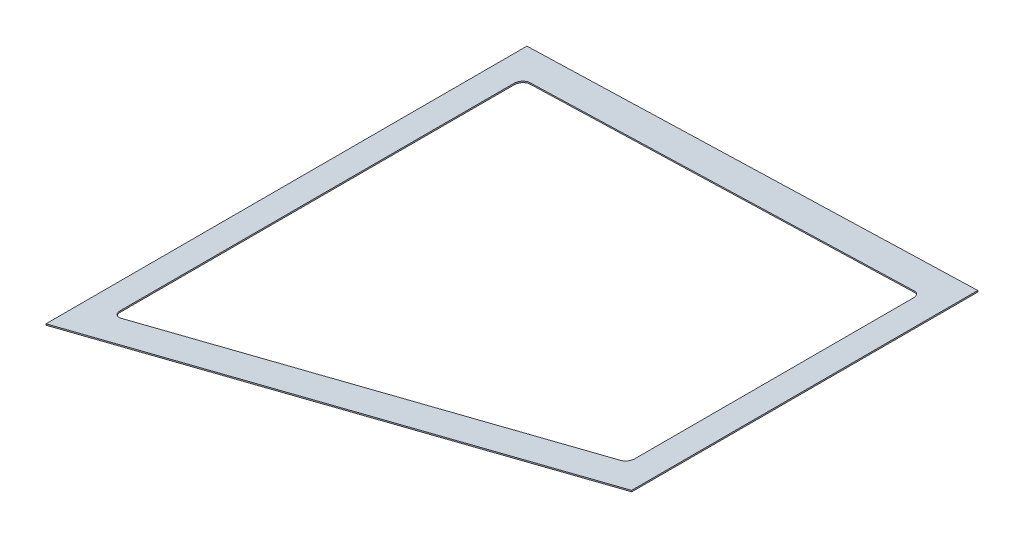
ISO-10303-21;
HEADER;
FILE_DESCRIPTION(('STEP AP214'),'2;1');
FILE_NAME('part.step','',(''),(''),'','','');
FILE_SCHEMA(('AUTOMOTIVE_DESIGN { 1 0 10303 214 1 1 1 1 }'));
ENDSEC;
DATA;
#1=APPLICATION_CONTEXT('core data for automotive mechanical design processes');
#2=APPLICATION_PROTOCOL_DEFINITION('international standard','automotive_design',2000,#1);
#3=PRODUCT_CONTEXT('',#1,'mechanical');
#4=PRODUCT('Part','Part','',(#3));
#5=PRODUCT_RELATED_PRODUCT_CATEGORY('part','',(#4));
#6=PRODUCT_DEFINITION_FORMATION('','',#4);
#7=PRODUCT_DEFINITION_CONTEXT('part definition',#1,'design');
#8=PRODUCT_DEFINITION('design','',#6,#7);
#9=PRODUCT_DEFINITION_SHAPE('','',#8);
#10=(LENGTH_UNIT() NAMED_UNIT(*) SI_UNIT(.MILLI.,.METRE.));
#11=(NAMED_UNIT(*) PLANE_ANGLE_UNIT() SI_UNIT($,.RADIAN.));
#12=(NAMED_UNIT(*) SI_UNIT($,.STERADIAN.) SOLID_ANGLE_UNIT());
#13=UNCERTAINTY_MEASURE_WITH_UNIT(LENGTH_MEASURE(1.E-05),#10,'distance_accuracy_value','');
#14=(GEOMETRIC_REPRESENTATION_CONTEXT(3) GLOBAL_UNCERTAINTY_ASSIGNED_CONTEXT((#13)) GLOBAL_UNIT_ASSIGNED_CONTEXT((#10,
#11,#12)) REPRESENTATION_CONTEXT('',''));
#15=CARTESIAN_POINT('',(0.,0.,0.));
#16=DIRECTION('',(0.,0.,1.));
#17=DIRECTION('',(1.,0.,0.));
#18=AXIS2_PLACEMENT_3D('',#15,#16,#17);
#19=CARTESIAN_POINT('',(2090.86017918312,60.2389706566354,194.317166251865));
#20=DIRECTION('',(0.154776003065257,-0.987949588225606,0.));
#21=DIRECTION('',(0.987949588225606,0.154776003065257,0.));
#22=AXIS2_PLACEMENT_3D('',#19,#20,#21);
#23=PLANE('',#22);
#24=DIRECTION('',(-0.979909680727832,-0.153516440064927,0.127317399618708));
#25=VECTOR('',#24,1.);
#26=CARTESIAN_POINT('',(2509.68068330087,125.853010483855,139.90078631401));
#27=LINE('',#26,#25);
#28=CARTESIAN_POINT('',(2509.68068330087,125.853010483855,139.90078631401));
#29=VERTEX_POINT('',#28);
#30=CARTESIAN_POINT('',(2090.86017918312,60.2389706566354,194.317166251865));
#31=VERTEX_POINT('',#30);
#32=EDGE_CURVE('E189',#29,#31,#27,.T.);
#33=ORIENTED_EDGE('',*,*,#32,.T.);
#34=DIRECTION('',(0.,0.,-1.));
#35=VECTOR('',#34,1.);
#36=CARTESIAN_POINT('',(2090.86017918312,60.2389706566354,194.317166251865));
#37=LINE('',#36,#35);
#38=CARTESIAN_POINT('',(2090.86017918312,60.2389706566354,-194.317166251865));
#39=VERTEX_POINT('',#38);
#40=EDGE_CURVE('E192',#31,#39,#37,.T.);
#41=ORIENTED_EDGE('',*,*,#40,.T.);
#42=DIRECTION('',(0.979909680727832,0.153516440064927,0.127317399618708));
#43=VECTOR('',#42,1.);
#44=CARTESIAN_POINT('',(2509.68068330087,125.853010483855,-139.90078631401));
#45=LINE('',#44,#43);
#46=CARTESIAN_POINT('',(2509.68068330087,125.853010483855,-139.90078631401));
#47=VERTEX_POINT('',#46);
#48=EDGE_CURVE('E195',#39,#47,#45,.T.);
#49=ORIENTED_EDGE('',*,*,#48,.T.);
#50=DIRECTION('',(0.,0.,1.));
#51=VECTOR('',#50,1.);
#52=CARTESIAN_POINT('',(2509.68068330087,125.853010483855,-58.4447746409123));
#53=LINE('',#52,#51);
#54=EDGE_CURVE('E197',#47,#29,#53,.T.);
#55=ORIENTED_EDGE('',*,*,#54,.T.);
#56=EDGE_LOOP('',(#33,#41,#49,#55));
#57=FACE_BOUND('',#56,.T.);
#58=DIRECTION('',(-0.979909680727832,-0.153516440064927,0.127317399618708));
#59=VECTOR('',#58,1.);
#60=CARTESIAN_POINT('',(2479.80894510104,121.173188458234,118.576833620302));
#61=LINE('',#60,#59);
#62=CARTESIAN_POINT('',(2479.80894510104,121.173188458234,118.576833620302));
#63=VERTEX_POINT('',#62);
#64=CARTESIAN_POINT('',(2122.24131545328,65.1552608210602,165.034769172857));
#65=VERTEX_POINT('',#64);
#66=EDGE_CURVE('E132',#63,#65,#61,.T.);
#67=ORIENTED_EDGE('',*,*,#66,.F.);
#68=CARTESIAN_POINT('',(2479.05424606587,121.054954388832,112.625661460874));
#69=DIRECTION('',(0.154776003065257,-0.987949588225606,0.));
#70=DIRECTION('',(-0.987949588225606,-0.154776003065257,0.));
#71=AXIS2_PLACEMENT_3D('',#68,#69,#70);
#72=CIRCLE('',#71,6.00000000000027);
#73=CARTESIAN_POINT('',(2484.98194359523,121.983610407224,112.625661460874));
#74=VERTEX_POINT('',#73);
#75=EDGE_CURVE('E124',#74,#63,#72,.T.);
#76=ORIENTED_EDGE('',*,*,#75,.F.);
#77=DIRECTION('',(0.,0.,1.));
#78=VECTOR('',#77,1.);
#79=CARTESIAN_POINT('',(2484.98194359523,121.983610407224,-58.4447746409126));
#80=LINE('',#79,#78);
#81=CARTESIAN_POINT('',(2484.98194359522,121.983610407224,-112.625661460874));
#82=VERTEX_POINT('',#81);
#83=EDGE_CURVE('E157',#82,#74,#80,.T.);
#84=ORIENTED_EDGE('',*,*,#83,.F.);
#85=CARTESIAN_POINT('',(2479.05424606587,121.054954388832,-112.625661460874));
#86=DIRECTION('',(0.154776003065257,-0.987949588225606,0.));
#87=DIRECTION('',(0.987949588225606,0.154776003065257,0.));
#88=AXIS2_PLACEMENT_3D('',#85,#86,#87);
#89=CIRCLE('',#88,6.00000000000027);
#90=CARTESIAN_POINT('',(2479.80894510104,121.173188458234,-118.576833620302));
#91=VERTEX_POINT('',#90);
#92=EDGE_CURVE('E155',#91,#82,#89,.T.);
#93=ORIENTED_EDGE('',*,*,#92,.F.);
#94=DIRECTION('',(0.979909680727832,0.153516440064927,0.127317399618708));
#95=VECTOR('',#94,1.);
#96=CARTESIAN_POINT('',(2479.80894510104,121.173188458234,-118.576833620302));
#97=LINE('',#96,#95);
#98=CARTESIAN_POINT('',(2122.24131545328,65.1552608210602,-165.034769172857));
#99=VERTEX_POINT('',#98);
#100=EDGE_CURVE('E153',#99,#91,#97,.T.);
#101=ORIENTED_EDGE('',*,*,#100,.F.);
#102=CARTESIAN_POINT('',(2121.48661641812,65.0370267516584,-159.083597013428));
#103=DIRECTION('',(0.154776003065257,-0.987949588225606,0.));
#104=DIRECTION('',(0.987949588225606,0.154776003065257,0.));
#105=AXIS2_PLACEMENT_3D('',#102,#103,#104);
#106=CIRCLE('',#105,6.00000000000024);
#107=CARTESIAN_POINT('',(2115.55891888876,64.1083707332668,-159.083597013428));
#108=VERTEX_POINT('',#107);
#109=EDGE_CURVE('E151',#108,#99,#106,.T.);
#110=ORIENTED_EDGE('',*,*,#109,.F.);
#111=DIRECTION('',(0.,0.,-1.));
#112=VECTOR('',#111,1.);
#113=CARTESIAN_POINT('',(2115.55891888876,64.1083707332668,159.083597013428));
#114=LINE('',#113,#112);
#115=CARTESIAN_POINT('',(2115.55891888876,64.1083707332668,159.083597013428));
#116=VERTEX_POINT('',#115);
#117=EDGE_CURVE('E147',#116,#108,#114,.T.);
#118=ORIENTED_EDGE('',*,*,#117,.F.);
#119=CARTESIAN_POINT('',(2121.48661641812,65.0370267516584,159.083597013428));
#120=DIRECTION('',(0.154776003065257,-0.987949588225606,0.));
#121=DIRECTION('',(-0.987949588225606,-0.154776003065257,0.));
#122=AXIS2_PLACEMENT_3D('',#119,#120,#121);
#123=CIRCLE('',#122,6.00000000000024);
#124=EDGE_CURVE('E145',#65,#116,#123,.T.);
#125=ORIENTED_EDGE('',*,*,#124,.F.);
#126=EDGE_LOOP('',(#67,#76,#84,#93,#101,#110,#118,#125));
#127=FACE_BOUND('',#126,.T.);
#128=ADVANCED_FACE('F35',(#57,#127),#23,.T.);
#129=CARTESIAN_POINT('',(2090.70540318006,61.226920244861,194.317166251865));
#130=DIRECTION('',(0.154776003065257,-0.987949588225606,0.));
#131=DIRECTION('',(0.987949588225606,0.154776003065257,0.));
#132=AXIS2_PLACEMENT_3D('',#129,#130,#131);
#133=PLANE('',#132);
#134=DIRECTION('',(-0.979909680727832,-0.153516440064927,0.127317399618708));
#135=VECTOR('',#134,1.);
#136=CARTESIAN_POINT('',(2509.5259072978,126.840960072081,139.90078631401));
#137=LINE('',#136,#135);
#138=CARTESIAN_POINT('',(2509.5259072978,126.840960072081,139.90078631401));
#139=VERTEX_POINT('',#138);
#140=CARTESIAN_POINT('',(2090.70540318006,61.226920244861,194.317166251865));
#141=VERTEX_POINT('',#140);
#142=EDGE_CURVE('E140',#139,#141,#137,.T.);
#143=ORIENTED_EDGE('',*,*,#142,.F.);
#144=DIRECTION('',(0.,0.,1.));
#145=VECTOR('',#144,1.);
#146=CARTESIAN_POINT('',(2509.5259072978,126.840960072081,58.4447746409121));
#147=LINE('',#146,#145);
#148=CARTESIAN_POINT('',(2509.5259072978,126.840960072081,-139.90078631401));
#149=VERTEX_POINT('',#148);
#150=EDGE_CURVE('E193',#149,#139,#147,.T.);
#151=ORIENTED_EDGE('',*,*,#150,.F.);
#152=DIRECTION('',(0.979909680727832,0.153516440064927,0.127317399618708));
#153=VECTOR('',#152,1.);
#154=CARTESIAN_POINT('',(2509.5259072978,126.840960072081,-139.90078631401));
#155=LINE('',#154,#153);
#156=CARTESIAN_POINT('',(2090.70540318006,61.226920244861,-194.317166251865));
#157=VERTEX_POINT('',#156);
#158=EDGE_CURVE('E204',#157,#149,#155,.T.);
#159=ORIENTED_EDGE('',*,*,#158,.F.);
#160=DIRECTION('',(0.,0.,-1.));
#161=VECTOR('',#160,1.);
#162=CARTESIAN_POINT('',(2090.70540318006,61.226920244861,194.317166251865));
#163=LINE('',#162,#161);
#164=EDGE_CURVE('E202',#141,#157,#163,.T.);
#165=ORIENTED_EDGE('',*,*,#164,.F.);
#166=EDGE_LOOP('',(#143,#151,#159,#165));
#167=FACE_BOUND('',#166,.T.);
#168=CARTESIAN_POINT('',(2478.89947006281,122.042903977058,112.625661460874));
#169=DIRECTION('',(0.154776003065257,-0.987949588225606,0.));
#170=DIRECTION('',(-0.987949588225606,-0.154776003065257,0.));
#171=AXIS2_PLACEMENT_3D('',#168,#169,#170);
#172=CIRCLE('',#171,6.00000000000027);
#173=CARTESIAN_POINT('',(2484.82716759216,122.97155999545,112.625661460874));
#174=VERTEX_POINT('',#173);
#175=CARTESIAN_POINT('',(2479.65416909797,122.16113804646,118.576833620302));
#176=VERTEX_POINT('',#175);
#177=EDGE_CURVE('E58',#174,#176,#172,.T.);
#178=ORIENTED_EDGE('',*,*,#177,.T.);
#179=DIRECTION('',(-0.979909680727832,-0.153516440064927,0.127317399618708));
#180=VECTOR('',#179,1.);
#181=CARTESIAN_POINT('',(2479.65416909797,122.16113804646,118.576833620302));
#182=LINE('',#181,#180);
#183=CARTESIAN_POINT('',(2122.08653945021,66.1432104092858,165.034769172857));
#184=VERTEX_POINT('',#183);
#185=EDGE_CURVE('E139',#176,#184,#182,.T.);
#186=ORIENTED_EDGE('',*,*,#185,.T.);
#187=CARTESIAN_POINT('',(2121.33184041505,66.024976339884,159.083597013428));
#188=DIRECTION('',(0.154776003065257,-0.987949588225606,0.));
#189=DIRECTION('',(-0.987949588225606,-0.154776003065257,0.));
#190=AXIS2_PLACEMENT_3D('',#187,#188,#189);
#191=CIRCLE('',#190,6.00000000000024);
#192=CARTESIAN_POINT('',(2115.4041428857,65.0963203214924,159.083597013428));
#193=VERTEX_POINT('',#192);
#194=EDGE_CURVE('E161',#184,#193,#191,.T.);
#195=ORIENTED_EDGE('',*,*,#194,.T.);
#196=DIRECTION('',(0.,0.,-1.));
#197=VECTOR('',#196,1.);
#198=CARTESIAN_POINT('',(2115.4041428857,65.0963203214924,159.083597013428));
#199=LINE('',#198,#197);
#200=CARTESIAN_POINT('',(2115.4041428857,65.0963203214924,-159.083597013428));
#201=VERTEX_POINT('',#200);
#202=EDGE_CURVE('E164',#193,#201,#199,.T.);
#203=ORIENTED_EDGE('',*,*,#202,.T.);
#204=CARTESIAN_POINT('',(2121.33184041505,66.024976339884,-159.083597013428));
#205=DIRECTION('',(0.154776003065257,-0.987949588225606,0.));
#206=DIRECTION('',(0.987949588225606,0.154776003065257,0.));
#207=AXIS2_PLACEMENT_3D('',#204,#205,#206);
#208=CIRCLE('',#207,6.00000000000024);
#209=CARTESIAN_POINT('',(2122.08653945021,66.1432104092858,-165.034769172857));
#210=VERTEX_POINT('',#209);
#211=EDGE_CURVE('E167',#201,#210,#208,.T.);
#212=ORIENTED_EDGE('',*,*,#211,.T.);
#213=DIRECTION('',(0.979909680727832,0.153516440064927,0.127317399618708));
#214=VECTOR('',#213,1.);
#215=CARTESIAN_POINT('',(2479.65416909797,122.16113804646,-118.576833620302));
#216=LINE('',#215,#214);
#217=CARTESIAN_POINT('',(2479.65416909797,122.16113804646,-118.576833620302));
#218=VERTEX_POINT('',#217);
#219=EDGE_CURVE('E170',#210,#218,#216,.T.);
#220=ORIENTED_EDGE('',*,*,#219,.T.);
#221=CARTESIAN_POINT('',(2478.89947006281,122.042903977058,-112.625661460874));
#222=DIRECTION('',(0.154776003065257,-0.987949588225606,0.));
#223=DIRECTION('',(0.987949588225606,0.154776003065257,0.));
#224=AXIS2_PLACEMENT_3D('',#221,#222,#223);
#225=CIRCLE('',#224,6.00000000000027);
#226=CARTESIAN_POINT('',(2484.82716759216,122.971559995449,-112.625661460874));
#227=VERTEX_POINT('',#226);
#228=EDGE_CURVE('E173',#218,#227,#225,.T.);
#229=ORIENTED_EDGE('',*,*,#228,.T.);
#230=DIRECTION('',(0.,0.,1.));
#231=VECTOR('',#230,1.);
#232=CARTESIAN_POINT('',(2484.82716759216,122.971559995449,58.4447746409123));
#233=LINE('',#232,#231);
#234=EDGE_CURVE('E133',#227,#174,#233,.T.);
#235=ORIENTED_EDGE('',*,*,#234,.T.);
#236=EDGE_LOOP('',(#178,#186,#195,#203,#212,#220,#229,#235));
#237=FACE_BOUND('',#236,.T.);
#238=ADVANCED_FACE('F222',(#167,#237),#133,.F.);
#239=CARTESIAN_POINT('',(2509.68068330087,125.853010483855,139.90078631401));
#240=DIRECTION('',(-0.125783172527258,-0.0197056782336455,-0.991862026571403));
#241=DIRECTION('',(-0.992054659508548,0.,0.12580760131001));
#242=AXIS2_PLACEMENT_3D('',#239,#240,#241);
#243=PLANE('',#242);
#244=ORIENTED_EDGE('',*,*,#142,.T.);
#245=DIRECTION('',(-0.154776003065256,0.987949588225606,0.));
#246=VECTOR('',#245,1.);
#247=CARTESIAN_POINT('',(2090.86017918312,60.2389706566354,194.317166251865));
#248=LINE('',#247,#246);
#249=EDGE_CURVE('E11',#31,#141,#248,.T.);
#250=ORIENTED_EDGE('',*,*,#249,.F.);
#251=ORIENTED_EDGE('',*,*,#32,.F.);
#252=DIRECTION('',(-0.154776003065256,0.987949588225606,0.));
#253=VECTOR('',#252,1.);
#254=CARTESIAN_POINT('',(2509.68068330087,125.853010483855,139.90078631401));
#255=LINE('',#254,#253);
#256=EDGE_CURVE('E199',#29,#139,#255,.T.);
#257=ORIENTED_EDGE('',*,*,#256,.T.);
#258=EDGE_LOOP('',(#244,#250,#251,#257));
#259=FACE_BOUND('',#258,.T.);
#260=ADVANCED_FACE('F37',(#259),#243,.F.);
#261=CARTESIAN_POINT('',(2090.86017918312,60.2389706566354,194.317166251865));
#262=DIRECTION('',(0.987949588225606,0.154776003065256,0.));
#263=DIRECTION('',(-0.154776003065257,0.987949588225606,0.));
#264=AXIS2_PLACEMENT_3D('',#261,#262,#263);
#265=PLANE('',#264);
#266=ORIENTED_EDGE('',*,*,#164,.T.);
#267=DIRECTION('',(-0.154776003065256,0.987949588225606,0.));
#268=VECTOR('',#267,1.);
#269=CARTESIAN_POINT('',(2090.86017918312,60.2389706566354,-194.317166251865));
#270=LINE('',#269,#268);
#271=EDGE_CURVE('E43',#39,#157,#270,.T.);
#272=ORIENTED_EDGE('',*,*,#271,.F.);
#273=ORIENTED_EDGE('',*,*,#40,.F.);
#274=ORIENTED_EDGE('',*,*,#249,.T.);
#275=EDGE_LOOP('',(#266,#272,#273,#274));
#276=FACE_BOUND('',#275,.T.);
#277=ADVANCED_FACE('F232',(#276),#265,.F.);
#278=CARTESIAN_POINT('',(2509.68068330087,125.853010483855,-139.90078631401));
#279=DIRECTION('',(-0.125783172527257,-0.0197056782336458,0.991862026571403));
#280=DIRECTION('',(0.992054659508548,0.,0.12580760131001));
#281=AXIS2_PLACEMENT_3D('',#278,#279,#280);
#282=PLANE('',#281);
#283=ORIENTED_EDGE('',*,*,#158,.T.);
#284=DIRECTION('',(-0.154776003065256,0.987949588225606,0.));
#285=VECTOR('',#284,1.);
#286=CARTESIAN_POINT('',(2509.68068330087,125.853010483855,-139.90078631401));
#287=LINE('',#286,#285);
#288=EDGE_CURVE('E210',#47,#149,#287,.T.);
#289=ORIENTED_EDGE('',*,*,#288,.F.);
#290=ORIENTED_EDGE('',*,*,#48,.F.);
#291=ORIENTED_EDGE('',*,*,#271,.T.);
#292=EDGE_LOOP('',(#283,#289,#290,#291));
#293=FACE_BOUND('',#292,.T.);
#294=ADVANCED_FACE('F217',(#293),#282,.F.);
#295=CARTESIAN_POINT('',(2509.68068330087,125.853010483855,58.4447746409121));
#296=DIRECTION('',(-0.987949588225606,-0.154776003065256,0.));
#297=DIRECTION('',(0.154776003065257,-0.987949588225606,0.));
#298=AXIS2_PLACEMENT_3D('',#295,#296,#297);
#299=PLANE('',#298);
#300=ORIENTED_EDGE('',*,*,#150,.T.);
#301=ORIENTED_EDGE('',*,*,#256,.F.);
#302=ORIENTED_EDGE('',*,*,#54,.F.);
#303=ORIENTED_EDGE('',*,*,#288,.T.);
#304=EDGE_LOOP('',(#300,#301,#302,#303));
#305=FACE_BOUND('',#304,.T.);
#306=ADVANCED_FACE('F226',(#305),#299,.F.);
#307=CARTESIAN_POINT('',(2479.05424606587,121.054954388832,112.625661460874));
#308=DIRECTION('',(-0.154776003065256,0.987949588225606,0.));
#309=DIRECTION('',(-0.987949588225606,-0.154776003065257,0.));
#310=AXIS2_PLACEMENT_3D('',#307,#308,#309);
#311=CYLINDRICAL_SURFACE('',#310,6.00000000000027);
#312=ORIENTED_EDGE('',*,*,#177,.F.);
#313=DIRECTION('',(-0.154776003065256,0.987949588225606,0.));
#314=VECTOR('',#313,1.);
#315=CARTESIAN_POINT('',(2484.98194359523,121.983610407224,112.625661460874));
#316=LINE('',#315,#314);
#317=EDGE_CURVE('E128',#74,#174,#316,.T.);
#318=ORIENTED_EDGE('',*,*,#317,.F.);
#319=ORIENTED_EDGE('',*,*,#75,.T.);
#320=DIRECTION('',(-0.154776003065256,0.987949588225606,0.));
#321=VECTOR('',#320,1.);
#322=CARTESIAN_POINT('',(2479.80894510104,121.173188458234,118.576833620302));
#323=LINE('',#322,#321);
#324=EDGE_CURVE('E127',#63,#176,#323,.T.);
#325=ORIENTED_EDGE('',*,*,#324,.T.);
#326=EDGE_LOOP('',(#312,#318,#319,#325));
#327=FACE_BOUND('',#326,.T.);
#328=ADVANCED_FACE('F126',(#327),#311,.F.);
#329=CARTESIAN_POINT('',(2479.80894510104,121.173188458234,118.576833620302));
#330=DIRECTION('',(-0.125783172527257,-0.0197056782336455,-0.991862026571403));
#331=DIRECTION('',(-0.992054659508548,0.,0.12580760131001));
#332=AXIS2_PLACEMENT_3D('',#329,#330,#331);
#333=PLANE('',#332);
#334=ORIENTED_EDGE('',*,*,#185,.F.);
#335=ORIENTED_EDGE('',*,*,#324,.F.);
#336=ORIENTED_EDGE('',*,*,#66,.T.);
#337=DIRECTION('',(-0.154776003065256,0.987949588225606,0.));
#338=VECTOR('',#337,1.);
#339=CARTESIAN_POINT('',(2122.24131545328,65.1552608210602,165.034769172857));
#340=LINE('',#339,#338);
#341=EDGE_CURVE('E141',#65,#184,#340,.T.);
#342=ORIENTED_EDGE('',*,*,#341,.T.);
#343=EDGE_LOOP('',(#334,#335,#336,#342));
#344=FACE_BOUND('',#343,.T.);
#345=ADVANCED_FACE('F136',(#344),#333,.T.);
#346=CARTESIAN_POINT('',(2121.48661641812,65.0370267516584,159.083597013428));
#347=DIRECTION('',(-0.154776003065256,0.987949588225606,0.));
#348=DIRECTION('',(-0.987949588225606,-0.154776003065257,0.));
#349=AXIS2_PLACEMENT_3D('',#346,#347,#348);
#350=CYLINDRICAL_SURFACE('',#349,6.00000000000024);
#351=ORIENTED_EDGE('',*,*,#194,.F.);
#352=ORIENTED_EDGE('',*,*,#341,.F.);
#353=ORIENTED_EDGE('',*,*,#124,.T.);
#354=DIRECTION('',(-0.154776003065256,0.987949588225606,0.));
#355=VECTOR('',#354,1.);
#356=CARTESIAN_POINT('',(2115.55891888876,64.1083707332668,159.083597013428));
#357=LINE('',#356,#355);
#358=EDGE_CURVE('E186',#116,#193,#357,.T.);
#359=ORIENTED_EDGE('',*,*,#358,.T.);
#360=EDGE_LOOP('',(#351,#352,#353,#359));
#361=FACE_BOUND('',#360,.T.);
#362=ADVANCED_FACE('F255',(#361),#350,.F.);
#363=CARTESIAN_POINT('',(2115.55891888876,64.1083707332668,159.083597013428));
#364=DIRECTION('',(0.987949588225606,0.154776003065256,0.));
#365=DIRECTION('',(-0.154776003065257,0.987949588225606,0.));
#366=AXIS2_PLACEMENT_3D('',#363,#364,#365);
#367=PLANE('',#366);
#368=ORIENTED_EDGE('',*,*,#202,.F.);
#369=ORIENTED_EDGE('',*,*,#358,.F.);
#370=ORIENTED_EDGE('',*,*,#117,.T.);
#371=DIRECTION('',(-0.154776003065256,0.987949588225606,0.));
#372=VECTOR('',#371,1.);
#373=CARTESIAN_POINT('',(2115.55891888876,64.1083707332668,-159.083597013428));
#374=LINE('',#373,#372);
#375=EDGE_CURVE('E184',#108,#201,#374,.T.);
#376=ORIENTED_EDGE('',*,*,#375,.T.);
#377=EDGE_LOOP('',(#368,#369,#370,#376));
#378=FACE_BOUND('',#377,.T.);
#379=ADVANCED_FACE('F259',(#378),#367,.T.);
#380=CARTESIAN_POINT('',(2121.48661641812,65.0370267516584,-159.083597013428));
#381=DIRECTION('',(-0.154776003065256,0.987949588225606,0.));
#382=DIRECTION('',(-0.987949588225606,-0.154776003065257,0.));
#383=AXIS2_PLACEMENT_3D('',#380,#381,#382);
#384=CYLINDRICAL_SURFACE('',#383,6.00000000000024);
#385=ORIENTED_EDGE('',*,*,#211,.F.);
#386=ORIENTED_EDGE('',*,*,#375,.F.);
#387=ORIENTED_EDGE('',*,*,#109,.T.);
#388=DIRECTION('',(-0.154776003065256,0.987949588225606,0.));
#389=VECTOR('',#388,1.);
#390=CARTESIAN_POINT('',(2122.24131545328,65.1552608210602,-165.034769172857));
#391=LINE('',#390,#389);
#392=EDGE_CURVE('E182',#99,#210,#391,.T.);
#393=ORIENTED_EDGE('',*,*,#392,.T.);
#394=EDGE_LOOP('',(#385,#386,#387,#393));
#395=FACE_BOUND('',#394,.T.);
#396=ADVANCED_FACE('F265',(#395),#384,.F.);
#397=CARTESIAN_POINT('',(2479.80894510104,121.173188458234,-118.576833620302));
#398=DIRECTION('',(-0.125783172527257,-0.0197056782336457,0.991862026571403));
#399=DIRECTION('',(0.992054659508548,0.,0.12580760131001));
#400=AXIS2_PLACEMENT_3D('',#397,#398,#399);
#401=PLANE('',#400);
#402=ORIENTED_EDGE('',*,*,#219,.F.);
#403=ORIENTED_EDGE('',*,*,#392,.F.);
#404=ORIENTED_EDGE('',*,*,#100,.T.);
#405=DIRECTION('',(-0.154776003065256,0.987949588225606,0.));
#406=VECTOR('',#405,1.);
#407=CARTESIAN_POINT('',(2479.80894510104,121.173188458234,-118.576833620302));
#408=LINE('',#407,#406);
#409=EDGE_CURVE('E180',#91,#218,#408,.T.);
#410=ORIENTED_EDGE('',*,*,#409,.T.);
#411=EDGE_LOOP('',(#402,#403,#404,#410));
#412=FACE_BOUND('',#411,.T.);
#413=ADVANCED_FACE('F269',(#412),#401,.T.);
#414=CARTESIAN_POINT('',(2479.05424606587,121.054954388832,-112.625661460874));
#415=DIRECTION('',(-0.154776003065256,0.987949588225606,0.));
#416=DIRECTION('',(-0.987949588225606,-0.154776003065257,0.));
#417=AXIS2_PLACEMENT_3D('',#414,#415,#416);
#418=CYLINDRICAL_SURFACE('',#417,6.00000000000027);
#419=ORIENTED_EDGE('',*,*,#228,.F.);
#420=ORIENTED_EDGE('',*,*,#409,.F.);
#421=ORIENTED_EDGE('',*,*,#92,.T.);
#422=DIRECTION('',(-0.154776003065256,0.987949588225606,0.));
#423=VECTOR('',#422,1.);
#424=CARTESIAN_POINT('',(2484.98194359523,121.983610407224,-112.625661460874));
#425=LINE('',#424,#423);
#426=EDGE_CURVE('E50',#82,#227,#425,.T.);
#427=ORIENTED_EDGE('',*,*,#426,.T.);
#428=EDGE_LOOP('',(#419,#420,#421,#427));
#429=FACE_BOUND('',#428,.T.);
#430=ADVANCED_FACE('F273',(#429),#418,.F.);
#431=CARTESIAN_POINT('',(2484.98194359523,121.983610407224,58.4447746409123));
#432=DIRECTION('',(-0.987949588225606,-0.154776003065256,0.));
#433=DIRECTION('',(0.154776003065257,-0.987949588225606,0.));
#434=AXIS2_PLACEMENT_3D('',#431,#432,#433);
#435=PLANE('',#434);
#436=ORIENTED_EDGE('',*,*,#234,.F.);
#437=ORIENTED_EDGE('',*,*,#426,.F.);
#438=ORIENTED_EDGE('',*,*,#83,.T.);
#439=ORIENTED_EDGE('',*,*,#317,.T.);
#440=EDGE_LOOP('',(#436,#437,#438,#439));
#441=FACE_BOUND('',#440,.T.);
#442=ADVANCED_FACE('F277',(#441),#435,.T.);
#443=CLOSED_SHELL('',(#128,#238,#260,#277,#294,#306,#328,#345,#362,#379,#396,#413,#430,#442));
#444=MANIFOLD_SOLID_BREP('B2',#443);
#445=ADVANCED_BREP_SHAPE_REPRESENTATION('',(#18,#444),#14);
#446=SHAPE_DEFINITION_REPRESENTATION(#9,#445);
ENDSEC;
END-ISO-10303-21;
